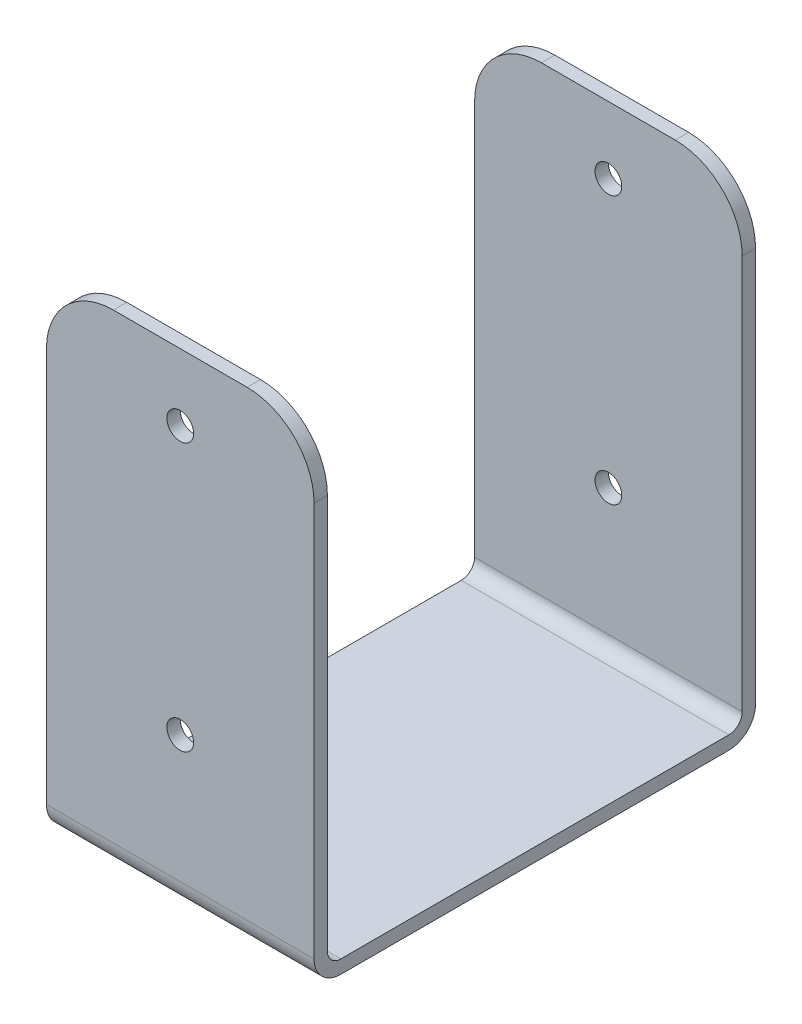
ISO-10303-21;
HEADER;
FILE_DESCRIPTION(('STEP AP214'),'2;1');
FILE_NAME('part.step','',(''),(''),'','','');
FILE_SCHEMA(('AUTOMOTIVE_DESIGN { 1 0 10303 214 1 1 1 1 }'));
ENDSEC;
DATA;
#1=APPLICATION_CONTEXT('core data for automotive mechanical design processes');
#2=APPLICATION_PROTOCOL_DEFINITION('international standard','automotive_design',2000,#1);
#3=PRODUCT_CONTEXT('',#1,'mechanical');
#4=PRODUCT('Part','Part','',(#3));
#5=PRODUCT_RELATED_PRODUCT_CATEGORY('part','',(#4));
#6=PRODUCT_DEFINITION_FORMATION('','',#4);
#7=PRODUCT_DEFINITION_CONTEXT('part definition',#1,'design');
#8=PRODUCT_DEFINITION('design','',#6,#7);
#9=PRODUCT_DEFINITION_SHAPE('','',#8);
#10=(LENGTH_UNIT() NAMED_UNIT(*) SI_UNIT(.MILLI.,.METRE.));
#11=(NAMED_UNIT(*) PLANE_ANGLE_UNIT() SI_UNIT($,.RADIAN.));
#12=(NAMED_UNIT(*) SI_UNIT($,.STERADIAN.) SOLID_ANGLE_UNIT());
#13=UNCERTAINTY_MEASURE_WITH_UNIT(LENGTH_MEASURE(1.E-05),#10,'distance_accuracy_value','');
#14=(GEOMETRIC_REPRESENTATION_CONTEXT(3) GLOBAL_UNCERTAINTY_ASSIGNED_CONTEXT((#13)) GLOBAL_UNIT_ASSIGNED_CONTEXT((#10,
#11,#12)) REPRESENTATION_CONTEXT('',''));
#15=CARTESIAN_POINT('',(0.,0.,0.));
#16=DIRECTION('',(0.,0.,1.));
#17=DIRECTION('',(1.,0.,0.));
#18=AXIS2_PLACEMENT_3D('',#15,#16,#17);
#19=CARTESIAN_POINT('',(514.894917120642,23.3157017452683,-231.556360518351));
#20=DIRECTION('',(-1.,0.,0.));
#21=DIRECTION('',(0.,0.,1.));
#22=AXIS2_PLACEMENT_3D('',#19,#20,#21);
#23=CYLINDRICAL_SURFACE('',#22,1.);
#24=CARTESIAN_POINT('',(514.894917120642,23.3157017452683,-231.556360518351));
#25=DIRECTION('',(-1.,0.,0.));
#26=DIRECTION('',(0.,0.,1.));
#27=AXIS2_PLACEMENT_3D('',#24,#25,#26);
#28=CIRCLE('',#27,1.);
#29=CARTESIAN_POINT('',(514.894917120642,22.3157017452683,-231.556360518351));
#30=VERTEX_POINT('',#29);
#31=CARTESIAN_POINT('',(514.894917120642,23.3157017452683,-230.556360518351));
#32=VERTEX_POINT('',#31);
#33=EDGE_CURVE('E134',#30,#32,#28,.T.);
#34=ORIENTED_EDGE('',*,*,#33,.F.);
#35=DIRECTION('',(1.,0.,0.));
#36=VECTOR('',#35,1.);
#37=CARTESIAN_POINT('',(514.894917120642,22.3157017452683,-231.556360518351));
#38=LINE('',#37,#36);
#39=CARTESIAN_POINT('',(494.894917120642,22.3157017452683,-231.556360518351));
#40=VERTEX_POINT('',#39);
#41=EDGE_CURVE('E136',#40,#30,#38,.T.);
#42=ORIENTED_EDGE('',*,*,#41,.F.);
#43=CARTESIAN_POINT('',(494.894917120642,23.3157017452683,-231.556360518351));
#44=DIRECTION('',(-1.,0.,0.));
#45=DIRECTION('',(0.,0.,1.));
#46=AXIS2_PLACEMENT_3D('',#43,#44,#45);
#47=CIRCLE('',#46,1.);
#48=CARTESIAN_POINT('',(494.894917120642,23.3157017452683,-230.556360518351));
#49=VERTEX_POINT('',#48);
#50=EDGE_CURVE('E20',#49,#40,#47,.F.);
#51=ORIENTED_EDGE('',*,*,#50,.F.);
#52=DIRECTION('',(-1.,0.,0.));
#53=VECTOR('',#52,1.);
#54=CARTESIAN_POINT('',(514.894917120642,23.3157017452683,-230.556360518351));
#55=LINE('',#54,#53);
#56=EDGE_CURVE('E209',#32,#49,#55,.T.);
#57=ORIENTED_EDGE('',*,*,#56,.F.);
#58=EDGE_LOOP('',(#34,#42,#51,#57));
#59=FACE_BOUND('',#58,.T.);
#60=ADVANCED_FACE('F17',(#59),#23,.F.);
#61=CARTESIAN_POINT('',(514.894917120642,23.3157017452683,-260.556360518351));
#62=DIRECTION('',(-1.,0.,0.));
#63=DIRECTION('',(0.,0.,1.));
#64=AXIS2_PLACEMENT_3D('',#61,#62,#63);
#65=CYLINDRICAL_SURFACE('',#64,1.);
#66=CARTESIAN_POINT('',(514.894917120642,23.3157017452683,-260.556360518351));
#67=DIRECTION('',(-1.,0.,0.));
#68=DIRECTION('',(0.,0.,1.));
#69=AXIS2_PLACEMENT_3D('',#66,#67,#68);
#70=CIRCLE('',#69,1.);
#71=CARTESIAN_POINT('',(514.894917120642,23.3157017452683,-261.556360518351));
#72=VERTEX_POINT('',#71);
#73=CARTESIAN_POINT('',(514.894917120642,22.3157017452683,-260.556360518351));
#74=VERTEX_POINT('',#73);
#75=EDGE_CURVE('E220',#72,#74,#70,.T.);
#76=ORIENTED_EDGE('',*,*,#75,.F.);
#77=DIRECTION('',(1.,0.,0.));
#78=VECTOR('',#77,1.);
#79=CARTESIAN_POINT('',(514.894917120642,23.3157017452683,-261.556360518351));
#80=LINE('',#79,#78);
#81=CARTESIAN_POINT('',(494.894917120642,23.3157017452683,-261.556360518351));
#82=VERTEX_POINT('',#81);
#83=EDGE_CURVE('E204',#82,#72,#80,.T.);
#84=ORIENTED_EDGE('',*,*,#83,.F.);
#85=CARTESIAN_POINT('',(494.894917120642,23.3157017452683,-260.556360518351));
#86=DIRECTION('',(-1.,0.,0.));
#87=DIRECTION('',(0.,0.,1.));
#88=AXIS2_PLACEMENT_3D('',#85,#86,#87);
#89=CIRCLE('',#88,1.);
#90=CARTESIAN_POINT('',(494.894917120642,22.3157017452683,-260.556360518351));
#91=VERTEX_POINT('',#90);
#92=EDGE_CURVE('E267',#91,#82,#89,.F.);
#93=ORIENTED_EDGE('',*,*,#92,.F.);
#94=DIRECTION('',(1.,0.,0.));
#95=VECTOR('',#94,1.);
#96=CARTESIAN_POINT('',(514.894917120642,22.3157017452683,-260.556360518351));
#97=LINE('',#96,#95);
#98=EDGE_CURVE('E141',#74,#91,#97,.F.);
#99=ORIENTED_EDGE('',*,*,#98,.F.);
#100=EDGE_LOOP('',(#76,#84,#93,#99));
#101=FACE_BOUND('',#100,.T.);
#102=ADVANCED_FACE('F329',(#101),#65,.F.);
#103=CARTESIAN_POINT('',(504.894917120642,52.8157017452683,-226.256336518351));
#104=DIRECTION('',(0.,0.,-1.));
#105=DIRECTION('',(-1.,0.,0.));
#106=AXIS2_PLACEMENT_3D('',#103,#104,#105);
#107=CYLINDRICAL_SURFACE('',#106,1.);
#108=CARTESIAN_POINT('',(504.894917120642,52.8157017452683,-262.556360518351));
#109=DIRECTION('',(0.,0.,-1.));
#110=DIRECTION('',(-1.,0.,0.));
#111=AXIS2_PLACEMENT_3D('',#108,#109,#110);
#112=CIRCLE('',#111,1.);
#113=CARTESIAN_POINT('',(503.894917120642,52.8157017452683,-262.556360518351));
#114=VERTEX_POINT('',#113);
#115=EDGE_CURVE('E206',#114,#114,#112,.F.);
#116=ORIENTED_EDGE('',*,*,#115,.F.);
#117=EDGE_LOOP('',(#116));
#118=FACE_BOUND('',#117,.T.);
#119=CARTESIAN_POINT('',(504.894917120642,52.8157017452683,-261.556360518351));
#120=DIRECTION('',(0.,0.,-1.));
#121=DIRECTION('',(-1.,0.,0.));
#122=AXIS2_PLACEMENT_3D('',#119,#120,#121);
#123=CIRCLE('',#122,1.);
#124=CARTESIAN_POINT('',(503.894917120642,52.8157017452683,-261.556360518351));
#125=VERTEX_POINT('',#124);
#126=EDGE_CURVE('E261',#125,#125,#123,.T.);
#127=ORIENTED_EDGE('',*,*,#126,.F.);
#128=EDGE_LOOP('',(#127));
#129=FACE_BOUND('',#128,.T.);
#130=ADVANCED_FACE('F331',(#118,#129),#107,.F.);
#131=CARTESIAN_POINT('',(504.894917120642,32.8157017452683,-226.256336518351));
#132=DIRECTION('',(0.,0.,-1.));
#133=DIRECTION('',(-1.,0.,0.));
#134=AXIS2_PLACEMENT_3D('',#131,#132,#133);
#135=CYLINDRICAL_SURFACE('',#134,1.);
#136=CARTESIAN_POINT('',(504.894917120642,32.8157017452683,-262.556360518351));
#137=DIRECTION('',(0.,0.,-1.));
#138=DIRECTION('',(-1.,0.,0.));
#139=AXIS2_PLACEMENT_3D('',#136,#137,#138);
#140=CIRCLE('',#139,1.);
#141=CARTESIAN_POINT('',(503.894917120642,32.8157017452683,-262.556360518351));
#142=VERTEX_POINT('',#141);
#143=EDGE_CURVE('E252',#142,#142,#140,.F.);
#144=ORIENTED_EDGE('',*,*,#143,.F.);
#145=EDGE_LOOP('',(#144));
#146=FACE_BOUND('',#145,.T.);
#147=CARTESIAN_POINT('',(504.894917120642,32.8157017452683,-261.556360518351));
#148=DIRECTION('',(0.,0.,-1.));
#149=DIRECTION('',(-1.,0.,0.));
#150=AXIS2_PLACEMENT_3D('',#147,#148,#149);
#151=CIRCLE('',#150,1.);
#152=CARTESIAN_POINT('',(503.894917120642,32.8157017452683,-261.556360518351));
#153=VERTEX_POINT('',#152);
#154=EDGE_CURVE('E140',#153,#153,#151,.T.);
#155=ORIENTED_EDGE('',*,*,#154,.F.);
#156=EDGE_LOOP('',(#155));
#157=FACE_BOUND('',#156,.T.);
#158=ADVANCED_FACE('F337',(#146,#157),#135,.F.);
#159=CARTESIAN_POINT('',(499.894917120642,52.8157017452683,-269.960616829488));
#160=DIRECTION('',(0.,0.,-1.));
#161=DIRECTION('',(-1.,0.,0.));
#162=AXIS2_PLACEMENT_3D('',#159,#160,#161);
#163=CYLINDRICAL_SURFACE('',#162,5.);
#164=DIRECTION('',(0.,0.,1.));
#165=VECTOR('',#164,1.);
#166=CARTESIAN_POINT('',(499.894917120642,57.8157017452683,-262.556360518351));
#167=LINE('',#166,#165);
#168=CARTESIAN_POINT('',(499.894917120642,57.8157017452683,-262.556360518351));
#169=VERTEX_POINT('',#168);
#170=CARTESIAN_POINT('',(499.894917120642,57.8157017452683,-261.556360518351));
#171=VERTEX_POINT('',#170);
#172=EDGE_CURVE('E215',#169,#171,#167,.T.);
#173=ORIENTED_EDGE('',*,*,#172,.F.);
#174=CARTESIAN_POINT('',(499.894917120642,52.8157017452683,-262.556360518351));
#175=DIRECTION('',(0.,0.,-1.));
#176=DIRECTION('',(-1.,0.,0.));
#177=AXIS2_PLACEMENT_3D('',#174,#175,#176);
#178=CIRCLE('',#177,5.);
#179=CARTESIAN_POINT('',(494.894917120642,52.8157017452683,-262.556360518351));
#180=VERTEX_POINT('',#179);
#181=EDGE_CURVE('E198',#180,#169,#178,.T.);
#182=ORIENTED_EDGE('',*,*,#181,.F.);
#183=DIRECTION('',(0.,0.,-1.));
#184=VECTOR('',#183,1.);
#185=CARTESIAN_POINT('',(494.894917120642,52.8157017452683,-269.960616829488));
#186=LINE('',#185,#184);
#187=CARTESIAN_POINT('',(494.894917120642,52.8157017452683,-261.556360518351));
#188=VERTEX_POINT('',#187);
#189=EDGE_CURVE('E218',#180,#188,#186,.F.);
#190=ORIENTED_EDGE('',*,*,#189,.T.);
#191=CARTESIAN_POINT('',(499.894917120642,52.8157017452683,-261.556360518351));
#192=DIRECTION('',(0.,0.,-1.));
#193=DIRECTION('',(-1.,0.,0.));
#194=AXIS2_PLACEMENT_3D('',#191,#192,#193);
#195=CIRCLE('',#194,5.);
#196=EDGE_CURVE('E202',#171,#188,#195,.F.);
#197=ORIENTED_EDGE('',*,*,#196,.F.);
#198=EDGE_LOOP('',(#173,#182,#190,#197));
#199=FACE_BOUND('',#198,.T.);
#200=ADVANCED_FACE('F382',(#199),#163,.T.);
#201=CARTESIAN_POINT('',(514.894917120642,57.8157017452683,-262.556360518351));
#202=DIRECTION('',(0.,1.,0.));
#203=DIRECTION('',(0.,0.,1.));
#204=AXIS2_PLACEMENT_3D('',#201,#202,#203);
#205=PLANE('',#204);
#206=ORIENTED_EDGE('',*,*,#172,.T.);
#207=DIRECTION('',(1.,0.,0.));
#208=VECTOR('',#207,1.);
#209=CARTESIAN_POINT('',(514.894917120642,57.8157017452683,-261.556360518351));
#210=LINE('',#209,#208);
#211=CARTESIAN_POINT('',(509.894917120642,57.8157017452683,-261.556360518351));
#212=VERTEX_POINT('',#211);
#213=EDGE_CURVE('E199',#212,#171,#210,.F.);
#214=ORIENTED_EDGE('',*,*,#213,.F.);
#215=DIRECTION('',(0.,0.,-1.));
#216=VECTOR('',#215,1.);
#217=CARTESIAN_POINT('',(509.894917120642,57.8157017452683,-269.960616829488));
#218=LINE('',#217,#216);
#219=CARTESIAN_POINT('',(509.894917120642,57.8157017452683,-262.556360518351));
#220=VERTEX_POINT('',#219);
#221=EDGE_CURVE('E211',#220,#212,#218,.F.);
#222=ORIENTED_EDGE('',*,*,#221,.F.);
#223=DIRECTION('',(-1.,0.,0.));
#224=VECTOR('',#223,1.);
#225=CARTESIAN_POINT('',(514.894917120642,57.8157017452683,-262.556360518351));
#226=LINE('',#225,#224);
#227=EDGE_CURVE('E195',#169,#220,#226,.F.);
#228=ORIENTED_EDGE('',*,*,#227,.F.);
#229=EDGE_LOOP('',(#206,#214,#222,#228));
#230=FACE_BOUND('',#229,.T.);
#231=ADVANCED_FACE('F379',(#230),#205,.T.);
#232=CARTESIAN_POINT('',(509.894917120642,52.8157017452683,-269.960616829488));
#233=DIRECTION('',(0.,0.,-1.));
#234=DIRECTION('',(-1.,0.,0.));
#235=AXIS2_PLACEMENT_3D('',#232,#233,#234);
#236=CYLINDRICAL_SURFACE('',#235,5.);
#237=ORIENTED_EDGE('',*,*,#221,.T.);
#238=CARTESIAN_POINT('',(509.894917120642,52.8157017452683,-261.556360518351));
#239=DIRECTION('',(0.,0.,-1.));
#240=DIRECTION('',(-1.,0.,0.));
#241=AXIS2_PLACEMENT_3D('',#238,#239,#240);
#242=CIRCLE('',#241,5.);
#243=CARTESIAN_POINT('',(514.894917120642,52.8157017452683,-261.556360518351));
#244=VERTEX_POINT('',#243);
#245=EDGE_CURVE('E203',#244,#212,#242,.F.);
#246=ORIENTED_EDGE('',*,*,#245,.F.);
#247=DIRECTION('',(0.,0.,-1.));
#248=VECTOR('',#247,1.);
#249=CARTESIAN_POINT('',(514.894917120642,52.8157017452683,-269.960616829488));
#250=LINE('',#249,#248);
#251=CARTESIAN_POINT('',(514.894917120642,52.8157017452683,-262.556360518351));
#252=VERTEX_POINT('',#251);
#253=EDGE_CURVE('E213',#244,#252,#250,.T.);
#254=ORIENTED_EDGE('',*,*,#253,.T.);
#255=CARTESIAN_POINT('',(509.894917120642,52.8157017452683,-262.556360518351));
#256=DIRECTION('',(0.,0.,-1.));
#257=DIRECTION('',(-1.,0.,0.));
#258=AXIS2_PLACEMENT_3D('',#255,#256,#257);
#259=CIRCLE('',#258,5.);
#260=EDGE_CURVE('E194',#220,#252,#259,.T.);
#261=ORIENTED_EDGE('',*,*,#260,.F.);
#262=EDGE_LOOP('',(#237,#246,#254,#261));
#263=FACE_BOUND('',#262,.T.);
#264=ADVANCED_FACE('F321',(#263),#236,.T.);
#265=CARTESIAN_POINT('',(514.894917120642,22.3157017452683,-230.556360518351));
#266=DIRECTION('',(0.,0.,-1.));
#267=DIRECTION('',(-1.,0.,0.));
#268=AXIS2_PLACEMENT_3D('',#265,#266,#267);
#269=PLANE('',#268);
#270=CARTESIAN_POINT('',(509.894917120642,52.8157017452683,-230.556360518351));
#271=DIRECTION('',(0.,0.,-1.));
#272=DIRECTION('',(-1.,0.,0.));
#273=AXIS2_PLACEMENT_3D('',#270,#271,#272);
#274=CIRCLE('',#273,5.);
#275=CARTESIAN_POINT('',(514.894917120642,52.8157017452683,-230.556360518351));
#276=VERTEX_POINT('',#275);
#277=CARTESIAN_POINT('',(509.894917120642,57.8157017452683,-230.556360518351));
#278=VERTEX_POINT('',#277);
#279=EDGE_CURVE('E164',#276,#278,#274,.F.);
#280=ORIENTED_EDGE('',*,*,#279,.F.);
#281=DIRECTION('',(0.,1.,0.));
#282=VECTOR('',#281,1.);
#283=CARTESIAN_POINT('',(514.894917120642,69.9291697379944,-230.556360518351));
#284=LINE('',#283,#282);
#285=EDGE_CURVE('E178',#276,#32,#284,.F.);
#286=ORIENTED_EDGE('',*,*,#285,.T.);
#287=ORIENTED_EDGE('',*,*,#56,.T.);
#288=DIRECTION('',(0.,1.,0.));
#289=VECTOR('',#288,1.);
#290=CARTESIAN_POINT('',(494.894917120642,69.9291697379944,-230.556360518351));
#291=LINE('',#290,#289);
#292=CARTESIAN_POINT('',(494.894917120642,52.8157017452683,-230.556360518351));
#293=VERTEX_POINT('',#292);
#294=EDGE_CURVE('E133',#293,#49,#291,.F.);
#295=ORIENTED_EDGE('',*,*,#294,.F.);
#296=CARTESIAN_POINT('',(499.894917120642,52.8157017452683,-230.556360518351));
#297=DIRECTION('',(0.,0.,-1.));
#298=DIRECTION('',(-1.,0.,0.));
#299=AXIS2_PLACEMENT_3D('',#296,#297,#298);
#300=CIRCLE('',#299,5.);
#301=CARTESIAN_POINT('',(499.894917120642,57.8157017452683,-230.556360518351));
#302=VERTEX_POINT('',#301);
#303=EDGE_CURVE('E155',#302,#293,#300,.F.);
#304=ORIENTED_EDGE('',*,*,#303,.F.);
#305=DIRECTION('',(1.,0.,0.));
#306=VECTOR('',#305,1.);
#307=CARTESIAN_POINT('',(514.894917120642,57.8157017452683,-230.556360518351));
#308=LINE('',#307,#306);
#309=EDGE_CURVE('E160',#278,#302,#308,.F.);
#310=ORIENTED_EDGE('',*,*,#309,.F.);
#311=EDGE_LOOP('',(#280,#286,#287,#295,#304,#310));
#312=FACE_BOUND('',#311,.T.);
#313=CARTESIAN_POINT('',(504.894917120642,52.8157017452683,-230.556360518351));
#314=DIRECTION('',(0.,0.,-1.));
#315=DIRECTION('',(-1.,0.,0.));
#316=AXIS2_PLACEMENT_3D('',#313,#314,#315);
#317=CIRCLE('',#316,1.);
#318=CARTESIAN_POINT('',(503.894917120642,52.8157017452683,-230.556360518351));
#319=VERTEX_POINT('',#318);
#320=EDGE_CURVE('E190',#319,#319,#317,.F.);
#321=ORIENTED_EDGE('',*,*,#320,.T.);
#322=EDGE_LOOP('',(#321));
#323=FACE_BOUND('',#322,.T.);
#324=CARTESIAN_POINT('',(504.894917120642,32.8157017452683,-230.556360518351));
#325=DIRECTION('',(0.,0.,-1.));
#326=DIRECTION('',(-1.,0.,0.));
#327=AXIS2_PLACEMENT_3D('',#324,#325,#326);
#328=CIRCLE('',#327,1.);
#329=CARTESIAN_POINT('',(503.894917120642,32.8157017452683,-230.556360518351));
#330=VERTEX_POINT('',#329);
#331=EDGE_CURVE('E181',#330,#330,#328,.F.);
#332=ORIENTED_EDGE('',*,*,#331,.T.);
#333=EDGE_LOOP('',(#332));
#334=FACE_BOUND('',#333,.T.);
#335=ADVANCED_FACE('F273',(#312,#323,#334),#269,.T.);
#336=CARTESIAN_POINT('',(514.894917120642,22.3157017452683,-261.556360518351));
#337=DIRECTION('',(0.,1.,0.));
#338=DIRECTION('',(0.,0.,1.));
#339=AXIS2_PLACEMENT_3D('',#336,#337,#338);
#340=PLANE('',#339);
#341=ORIENTED_EDGE('',*,*,#41,.T.);
#342=DIRECTION('',(0.,0.,1.));
#343=VECTOR('',#342,1.);
#344=CARTESIAN_POINT('',(514.894917120642,22.3157017452683,-269.960616829488));
#345=LINE('',#344,#343);
#346=EDGE_CURVE('E176',#30,#74,#345,.F.);
#347=ORIENTED_EDGE('',*,*,#346,.T.);
#348=ORIENTED_EDGE('',*,*,#98,.T.);
#349=DIRECTION('',(0.,0.,1.));
#350=VECTOR('',#349,1.);
#351=CARTESIAN_POINT('',(494.894917120642,22.3157017452683,-269.960616829488));
#352=LINE('',#351,#350);
#353=EDGE_CURVE('E130',#40,#91,#352,.F.);
#354=ORIENTED_EDGE('',*,*,#353,.F.);
#355=EDGE_LOOP('',(#341,#347,#348,#354));
#356=FACE_BOUND('',#355,.T.);
#357=ADVANCED_FACE('F144',(#356),#340,.T.);
#358=CARTESIAN_POINT('',(514.894917120642,52.8157017452683,-261.556360518351));
#359=DIRECTION('',(0.,0.,1.));
#360=DIRECTION('',(1.,0.,0.));
#361=AXIS2_PLACEMENT_3D('',#358,#359,#360);
#362=PLANE('',#361);
#363=DIRECTION('',(0.,1.,0.));
#364=VECTOR('',#363,1.);
#365=CARTESIAN_POINT('',(494.894917120642,69.9291697379944,-261.556360518351));
#366=LINE('',#365,#364);
#367=EDGE_CURVE('E146',#82,#188,#366,.T.);
#368=ORIENTED_EDGE('',*,*,#367,.F.);
#369=ORIENTED_EDGE('',*,*,#83,.T.);
#370=DIRECTION('',(0.,1.,0.));
#371=VECTOR('',#370,1.);
#372=CARTESIAN_POINT('',(514.894917120642,69.9291697379944,-261.556360518351));
#373=LINE('',#372,#371);
#374=EDGE_CURVE('E173',#72,#244,#373,.T.);
#375=ORIENTED_EDGE('',*,*,#374,.T.);
#376=ORIENTED_EDGE('',*,*,#245,.T.);
#377=ORIENTED_EDGE('',*,*,#213,.T.);
#378=ORIENTED_EDGE('',*,*,#196,.T.);
#379=EDGE_LOOP('',(#368,#369,#375,#376,#377,#378));
#380=FACE_BOUND('',#379,.T.);
#381=ORIENTED_EDGE('',*,*,#126,.T.);
#382=EDGE_LOOP('',(#381));
#383=FACE_BOUND('',#382,.T.);
#384=ORIENTED_EDGE('',*,*,#154,.T.);
#385=EDGE_LOOP('',(#384));
#386=FACE_BOUND('',#385,.T.);
#387=ADVANCED_FACE('F325',(#380,#383,#386),#362,.T.);
#388=CARTESIAN_POINT('',(514.894917120642,21.3157017452683,-262.556360518351));
#389=DIRECTION('',(0.,0.,-1.));
#390=DIRECTION('',(-1.,0.,0.));
#391=AXIS2_PLACEMENT_3D('',#388,#389,#390);
#392=PLANE('',#391);
#393=ORIENTED_EDGE('',*,*,#260,.T.);
#394=DIRECTION('',(0.,1.,0.));
#395=VECTOR('',#394,1.);
#396=CARTESIAN_POINT('',(514.894917120642,69.9291697379944,-262.556360518351));
#397=LINE('',#396,#395);
#398=CARTESIAN_POINT('',(514.894917120642,23.3157017452683,-262.556360518351));
#399=VERTEX_POINT('',#398);
#400=EDGE_CURVE('E171',#252,#399,#397,.F.);
#401=ORIENTED_EDGE('',*,*,#400,.T.);
#402=DIRECTION('',(-1.,0.,0.));
#403=VECTOR('',#402,1.);
#404=CARTESIAN_POINT('',(514.894917120642,23.3157017452683,-262.556360518351));
#405=LINE('',#404,#403);
#406=CARTESIAN_POINT('',(494.894917120642,23.3157017452683,-262.556360518351));
#407=VERTEX_POINT('',#406);
#408=EDGE_CURVE('E191',#407,#399,#405,.F.);
#409=ORIENTED_EDGE('',*,*,#408,.F.);
#410=DIRECTION('',(0.,1.,0.));
#411=VECTOR('',#410,1.);
#412=CARTESIAN_POINT('',(494.894917120642,69.9291697379944,-262.556360518351));
#413=LINE('',#412,#411);
#414=EDGE_CURVE('E149',#180,#407,#413,.F.);
#415=ORIENTED_EDGE('',*,*,#414,.F.);
#416=ORIENTED_EDGE('',*,*,#181,.T.);
#417=ORIENTED_EDGE('',*,*,#227,.T.);
#418=EDGE_LOOP('',(#393,#401,#409,#415,#416,#417));
#419=FACE_BOUND('',#418,.T.);
#420=ORIENTED_EDGE('',*,*,#143,.T.);
#421=EDGE_LOOP('',(#420));
#422=FACE_BOUND('',#421,.T.);
#423=ORIENTED_EDGE('',*,*,#115,.T.);
#424=EDGE_LOOP('',(#423));
#425=FACE_BOUND('',#424,.T.);
#426=ADVANCED_FACE('F305',(#419,#422,#425),#392,.T.);
#427=CARTESIAN_POINT('',(514.894917120642,23.3157017452683,-260.556360518351));
#428=DIRECTION('',(-1.,0.,0.));
#429=DIRECTION('',(0.,0.,1.));
#430=AXIS2_PLACEMENT_3D('',#427,#428,#429);
#431=CYLINDRICAL_SURFACE('',#430,2.);
#432=DIRECTION('',(1.,0.,0.));
#433=VECTOR('',#432,1.);
#434=CARTESIAN_POINT('',(514.894917120642,21.3157017452683,-260.556360518351));
#435=LINE('',#434,#433);
#436=CARTESIAN_POINT('',(494.894917120642,21.3157017452683,-260.556360518351));
#437=VERTEX_POINT('',#436);
#438=CARTESIAN_POINT('',(514.894917120642,21.3157017452683,-260.556360518351));
#439=VERTEX_POINT('',#438);
#440=EDGE_CURVE('E187',#437,#439,#435,.T.);
#441=ORIENTED_EDGE('',*,*,#440,.F.);
#442=CARTESIAN_POINT('',(494.894917120642,23.3157017452683,-260.556360518351));
#443=DIRECTION('',(-1.,0.,0.));
#444=DIRECTION('',(0.,0.,1.));
#445=AXIS2_PLACEMENT_3D('',#442,#443,#444);
#446=CIRCLE('',#445,2.);
#447=EDGE_CURVE('E238',#407,#437,#446,.T.);
#448=ORIENTED_EDGE('',*,*,#447,.F.);
#449=ORIENTED_EDGE('',*,*,#408,.T.);
#450=CARTESIAN_POINT('',(514.894917120642,23.3157017452683,-260.556360518351));
#451=DIRECTION('',(-1.,0.,0.));
#452=DIRECTION('',(0.,0.,1.));
#453=AXIS2_PLACEMENT_3D('',#450,#451,#452);
#454=CIRCLE('',#453,2.);
#455=EDGE_CURVE('E170',#399,#439,#454,.T.);
#456=ORIENTED_EDGE('',*,*,#455,.T.);
#457=EDGE_LOOP('',(#441,#448,#449,#456));
#458=FACE_BOUND('',#457,.T.);
#459=ADVANCED_FACE('F310',(#458),#431,.T.);
#460=CARTESIAN_POINT('',(514.894917120642,21.3157017452683,-229.556360518351));
#461=DIRECTION('',(0.,-1.,0.));
#462=DIRECTION('',(0.,0.,-1.));
#463=AXIS2_PLACEMENT_3D('',#460,#461,#462);
#464=PLANE('',#463);
#465=ORIENTED_EDGE('',*,*,#440,.T.);
#466=DIRECTION('',(0.,0.,1.));
#467=VECTOR('',#466,1.);
#468=CARTESIAN_POINT('',(514.894917120642,21.3157017452683,-269.960616829488));
#469=LINE('',#468,#467);
#470=CARTESIAN_POINT('',(514.894917120642,21.3157017452683,-231.556360518351));
#471=VERTEX_POINT('',#470);
#472=EDGE_CURVE('E168',#439,#471,#469,.T.);
#473=ORIENTED_EDGE('',*,*,#472,.T.);
#474=DIRECTION('',(-1.,0.,0.));
#475=VECTOR('',#474,1.);
#476=CARTESIAN_POINT('',(514.894917120642,21.3157017452683,-231.556360518351));
#477=LINE('',#476,#475);
#478=CARTESIAN_POINT('',(494.894917120642,21.3157017452683,-231.556360518351));
#479=VERTEX_POINT('',#478);
#480=EDGE_CURVE('E182',#479,#471,#477,.F.);
#481=ORIENTED_EDGE('',*,*,#480,.F.);
#482=DIRECTION('',(0.,0.,1.));
#483=VECTOR('',#482,1.);
#484=CARTESIAN_POINT('',(494.894917120642,21.3157017452683,-269.960616829488));
#485=LINE('',#484,#483);
#486=EDGE_CURVE('E186',#437,#479,#485,.T.);
#487=ORIENTED_EDGE('',*,*,#486,.F.);
#488=EDGE_LOOP('',(#465,#473,#481,#487));
#489=FACE_BOUND('',#488,.T.);
#490=ADVANCED_FACE('F314',(#489),#464,.T.);
#491=CARTESIAN_POINT('',(504.894917120642,52.8157017452683,-226.256336518351));
#492=DIRECTION('',(0.,0.,-1.));
#493=DIRECTION('',(-1.,0.,0.));
#494=AXIS2_PLACEMENT_3D('',#491,#492,#493);
#495=CYLINDRICAL_SURFACE('',#494,1.);
#496=ORIENTED_EDGE('',*,*,#320,.F.);
#497=EDGE_LOOP('',(#496));
#498=FACE_BOUND('',#497,.T.);
#499=CARTESIAN_POINT('',(504.894917120642,52.8157017452683,-229.556360518351));
#500=DIRECTION('',(0.,0.,-1.));
#501=DIRECTION('',(-1.,0.,0.));
#502=AXIS2_PLACEMENT_3D('',#499,#500,#501);
#503=CIRCLE('',#502,1.);
#504=CARTESIAN_POINT('',(503.894917120642,52.8157017452683,-229.556360518351));
#505=VERTEX_POINT('',#504);
#506=EDGE_CURVE('E232',#505,#505,#503,.T.);
#507=ORIENTED_EDGE('',*,*,#506,.F.);
#508=EDGE_LOOP('',(#507));
#509=FACE_BOUND('',#508,.T.);
#510=ADVANCED_FACE('F360',(#498,#509),#495,.F.);
#511=CARTESIAN_POINT('',(504.894917120642,32.8157017452683,-226.256336518351));
#512=DIRECTION('',(0.,0.,-1.));
#513=DIRECTION('',(-1.,0.,0.));
#514=AXIS2_PLACEMENT_3D('',#511,#512,#513);
#515=CYLINDRICAL_SURFACE('',#514,1.);
#516=CARTESIAN_POINT('',(504.894917120642,32.8157017452683,-229.556360518351));
#517=DIRECTION('',(0.,0.,-1.));
#518=DIRECTION('',(-1.,0.,0.));
#519=AXIS2_PLACEMENT_3D('',#516,#517,#518);
#520=CIRCLE('',#519,1.);
#521=CARTESIAN_POINT('',(503.894917120642,32.8157017452683,-229.556360518351));
#522=VERTEX_POINT('',#521);
#523=EDGE_CURVE('E229',#522,#522,#520,.T.);
#524=ORIENTED_EDGE('',*,*,#523,.F.);
#525=EDGE_LOOP('',(#524));
#526=FACE_BOUND('',#525,.T.);
#527=ORIENTED_EDGE('',*,*,#331,.F.);
#528=EDGE_LOOP('',(#527));
#529=FACE_BOUND('',#528,.T.);
#530=ADVANCED_FACE('F357',(#526,#529),#515,.F.);
#531=CARTESIAN_POINT('',(514.894917120642,69.9291697379944,-269.960616829488));
#532=DIRECTION('',(-1.,0.,0.));
#533=DIRECTION('',(0.,0.,1.));
#534=AXIS2_PLACEMENT_3D('',#531,#532,#533);
#535=PLANE('',#534);
#536=DIRECTION('',(0.,1.,0.));
#537=VECTOR('',#536,1.);
#538=CARTESIAN_POINT('',(514.894917120642,52.8157017452683,-229.556360518351));
#539=LINE('',#538,#537);
#540=CARTESIAN_POINT('',(514.894917120642,23.3157017452683,-229.556360518351));
#541=VERTEX_POINT('',#540);
#542=CARTESIAN_POINT('',(514.894917120642,52.8157017452683,-229.556360518351));
#543=VERTEX_POINT('',#542);
#544=EDGE_CURVE('E228',#541,#543,#539,.T.);
#545=ORIENTED_EDGE('',*,*,#544,.F.);
#546=CARTESIAN_POINT('',(514.894917120642,23.3157017452683,-231.556360518351));
#547=DIRECTION('',(-1.,0.,0.));
#548=DIRECTION('',(0.,0.,1.));
#549=AXIS2_PLACEMENT_3D('',#546,#547,#548);
#550=CIRCLE('',#549,2.);
#551=EDGE_CURVE('E185',#471,#541,#550,.T.);
#552=ORIENTED_EDGE('',*,*,#551,.F.);
#553=ORIENTED_EDGE('',*,*,#472,.F.);
#554=ORIENTED_EDGE('',*,*,#455,.F.);
#555=ORIENTED_EDGE('',*,*,#400,.F.);
#556=ORIENTED_EDGE('',*,*,#253,.F.);
#557=ORIENTED_EDGE('',*,*,#374,.F.);
#558=ORIENTED_EDGE('',*,*,#75,.T.);
#559=ORIENTED_EDGE('',*,*,#346,.F.);
#560=ORIENTED_EDGE('',*,*,#33,.T.);
#561=ORIENTED_EDGE('',*,*,#285,.F.);
#562=DIRECTION('',(0.,0.,-1.));
#563=VECTOR('',#562,1.);
#564=CARTESIAN_POINT('',(514.894917120642,52.8157017452683,-269.960616829488));
#565=LINE('',#564,#563);
#566=EDGE_CURVE('E165',#543,#276,#565,.T.);
#567=ORIENTED_EDGE('',*,*,#566,.F.);
#568=EDGE_LOOP('',(#545,#552,#553,#554,#555,#556,#557,#558,#559,#560,#561,#567));
#569=FACE_BOUND('',#568,.T.);
#570=ADVANCED_FACE('F269',(#569),#535,.F.);
#571=CARTESIAN_POINT('',(509.894917120642,52.8157017452683,-269.960616829488));
#572=DIRECTION('',(0.,0.,-1.));
#573=DIRECTION('',(-1.,0.,0.));
#574=AXIS2_PLACEMENT_3D('',#571,#572,#573);
#575=CYLINDRICAL_SURFACE('',#574,5.);
#576=DIRECTION('',(0.,0.,1.));
#577=VECTOR('',#576,1.);
#578=CARTESIAN_POINT('',(509.894917120642,57.8157017452683,-230.556360518351));
#579=LINE('',#578,#577);
#580=CARTESIAN_POINT('',(509.894917120642,57.8157017452683,-229.556360518351));
#581=VERTEX_POINT('',#580);
#582=EDGE_CURVE('E161',#581,#278,#579,.F.);
#583=ORIENTED_EDGE('',*,*,#582,.F.);
#584=CARTESIAN_POINT('',(509.894917120642,52.8157017452683,-229.556360518351));
#585=DIRECTION('',(0.,0.,-1.));
#586=DIRECTION('',(-1.,0.,0.));
#587=AXIS2_PLACEMENT_3D('',#584,#585,#586);
#588=CIRCLE('',#587,5.);
#589=EDGE_CURVE('E225',#543,#581,#588,.F.);
#590=ORIENTED_EDGE('',*,*,#589,.F.);
#591=ORIENTED_EDGE('',*,*,#566,.T.);
#592=ORIENTED_EDGE('',*,*,#279,.T.);
#593=EDGE_LOOP('',(#583,#590,#591,#592));
#594=FACE_BOUND('',#593,.T.);
#595=ADVANCED_FACE('F280',(#594),#575,.T.);
#596=CARTESIAN_POINT('',(514.894917120642,57.8157017452683,-230.556360518351));
#597=DIRECTION('',(0.,1.,0.));
#598=DIRECTION('',(0.,0.,1.));
#599=AXIS2_PLACEMENT_3D('',#596,#597,#598);
#600=PLANE('',#599);
#601=DIRECTION('',(0.,0.,-1.));
#602=VECTOR('',#601,1.);
#603=CARTESIAN_POINT('',(499.894917120642,57.8157017452683,-269.960616829488));
#604=LINE('',#603,#602);
#605=CARTESIAN_POINT('',(499.894917120642,57.8157017452683,-229.556360518351));
#606=VERTEX_POINT('',#605);
#607=EDGE_CURVE('E157',#606,#302,#604,.T.);
#608=ORIENTED_EDGE('',*,*,#607,.F.);
#609=DIRECTION('',(1.,0.,0.));
#610=VECTOR('',#609,1.);
#611=CARTESIAN_POINT('',(514.894917120642,57.8157017452683,-229.556360518351));
#612=LINE('',#611,#610);
#613=EDGE_CURVE('E224',#581,#606,#612,.F.);
#614=ORIENTED_EDGE('',*,*,#613,.F.);
#615=ORIENTED_EDGE('',*,*,#582,.T.);
#616=ORIENTED_EDGE('',*,*,#309,.T.);
#617=EDGE_LOOP('',(#608,#614,#615,#616));
#618=FACE_BOUND('',#617,.T.);
#619=ADVANCED_FACE('F288',(#618),#600,.T.);
#620=CARTESIAN_POINT('',(499.894917120642,52.8157017452683,-269.960616829488));
#621=DIRECTION('',(0.,0.,-1.));
#622=DIRECTION('',(-1.,0.,0.));
#623=AXIS2_PLACEMENT_3D('',#620,#621,#622);
#624=CYLINDRICAL_SURFACE('',#623,5.);
#625=ORIENTED_EDGE('',*,*,#607,.T.);
#626=ORIENTED_EDGE('',*,*,#303,.T.);
#627=DIRECTION('',(0.,0.,1.));
#628=VECTOR('',#627,1.);
#629=CARTESIAN_POINT('',(494.894917120642,52.8157017452683,-269.960616829488));
#630=LINE('',#629,#628);
#631=CARTESIAN_POINT('',(494.894917120642,52.8157017452683,-229.556360518351));
#632=VERTEX_POINT('',#631);
#633=EDGE_CURVE('E151',#632,#293,#630,.F.);
#634=ORIENTED_EDGE('',*,*,#633,.F.);
#635=CARTESIAN_POINT('',(499.894917120642,52.8157017452683,-229.556360518351));
#636=DIRECTION('',(0.,0.,-1.));
#637=DIRECTION('',(-1.,0.,0.));
#638=AXIS2_PLACEMENT_3D('',#635,#636,#637);
#639=CIRCLE('',#638,5.);
#640=EDGE_CURVE('E221',#606,#632,#639,.F.);
#641=ORIENTED_EDGE('',*,*,#640,.F.);
#642=EDGE_LOOP('',(#625,#626,#634,#641));
#643=FACE_BOUND('',#642,.T.);
#644=ADVANCED_FACE('F291',(#643),#624,.T.);
#645=CARTESIAN_POINT('',(494.894917120642,69.9291697379944,-269.960616829488));
#646=DIRECTION('',(-1.,0.,0.));
#647=DIRECTION('',(0.,0.,1.));
#648=AXIS2_PLACEMENT_3D('',#645,#646,#647);
#649=PLANE('',#648);
#650=CARTESIAN_POINT('',(494.894917120642,23.3157017452683,-231.556360518351));
#651=DIRECTION('',(-1.,0.,0.));
#652=DIRECTION('',(0.,0.,1.));
#653=AXIS2_PLACEMENT_3D('',#650,#651,#652);
#654=CIRCLE('',#653,2.);
#655=CARTESIAN_POINT('',(494.894917120642,23.3157017452683,-229.556360518351));
#656=VERTEX_POINT('',#655);
#657=EDGE_CURVE('E35',#656,#479,#654,.F.);
#658=ORIENTED_EDGE('',*,*,#657,.F.);
#659=DIRECTION('',(0.,1.,0.));
#660=VECTOR('',#659,1.);
#661=CARTESIAN_POINT('',(494.894917120642,52.8157017452683,-229.556360518351));
#662=LINE('',#661,#660);
#663=EDGE_CURVE('E26',#632,#656,#662,.F.);
#664=ORIENTED_EDGE('',*,*,#663,.F.);
#665=ORIENTED_EDGE('',*,*,#633,.T.);
#666=ORIENTED_EDGE('',*,*,#294,.T.);
#667=ORIENTED_EDGE('',*,*,#50,.T.);
#668=ORIENTED_EDGE('',*,*,#353,.T.);
#669=ORIENTED_EDGE('',*,*,#92,.T.);
#670=ORIENTED_EDGE('',*,*,#367,.T.);
#671=ORIENTED_EDGE('',*,*,#189,.F.);
#672=ORIENTED_EDGE('',*,*,#414,.T.);
#673=ORIENTED_EDGE('',*,*,#447,.T.);
#674=ORIENTED_EDGE('',*,*,#486,.T.);
#675=EDGE_LOOP('',(#658,#664,#665,#666,#667,#668,#669,#670,#671,#672,#673,#674));
#676=FACE_BOUND('',#675,.T.);
#677=ADVANCED_FACE('F128',(#676),#649,.T.);
#678=CARTESIAN_POINT('',(514.894917120642,23.3157017452683,-231.556360518351));
#679=DIRECTION('',(-1.,0.,0.));
#680=DIRECTION('',(0.,0.,1.));
#681=AXIS2_PLACEMENT_3D('',#678,#679,#680);
#682=CYLINDRICAL_SURFACE('',#681,2.);
#683=DIRECTION('',(1.,0.,0.));
#684=VECTOR('',#683,1.);
#685=CARTESIAN_POINT('',(514.894917120642,23.3157017452683,-229.556360518351));
#686=LINE('',#685,#684);
#687=EDGE_CURVE('E11',#656,#541,#686,.T.);
#688=ORIENTED_EDGE('',*,*,#687,.F.);
#689=ORIENTED_EDGE('',*,*,#657,.T.);
#690=ORIENTED_EDGE('',*,*,#480,.T.);
#691=ORIENTED_EDGE('',*,*,#551,.T.);
#692=EDGE_LOOP('',(#688,#689,#690,#691));
#693=FACE_BOUND('',#692,.T.);
#694=ADVANCED_FACE('F316',(#693),#682,.T.);
#695=CARTESIAN_POINT('',(514.894917120642,52.8157017452683,-229.556360518351));
#696=DIRECTION('',(0.,0.,1.));
#697=DIRECTION('',(1.,0.,0.));
#698=AXIS2_PLACEMENT_3D('',#695,#696,#697);
#699=PLANE('',#698);
#700=ORIENTED_EDGE('',*,*,#663,.T.);
#701=ORIENTED_EDGE('',*,*,#687,.T.);
#702=ORIENTED_EDGE('',*,*,#544,.T.);
#703=ORIENTED_EDGE('',*,*,#589,.T.);
#704=ORIENTED_EDGE('',*,*,#613,.T.);
#705=ORIENTED_EDGE('',*,*,#640,.T.);
#706=EDGE_LOOP('',(#700,#701,#702,#703,#704,#705));
#707=FACE_BOUND('',#706,.T.);
#708=ORIENTED_EDGE('',*,*,#523,.T.);
#709=EDGE_LOOP('',(#708));
#710=FACE_BOUND('',#709,.T.);
#711=ORIENTED_EDGE('',*,*,#506,.T.);
#712=EDGE_LOOP('',(#711));
#713=FACE_BOUND('',#712,.T.);
#714=ADVANCED_FACE('F294',(#707,#710,#713),#699,.T.);
#715=CLOSED_SHELL('',(#60,#102,#130,#158,#200,#231,#264,#335,#357,#387,#426,#459,#490,#510,#530,
#570,#595,#619,#644,#677,#694,#714));
#716=MANIFOLD_SOLID_BREP('B1',#715);
#717=ADVANCED_BREP_SHAPE_REPRESENTATION('',(#18,#716),#14);
#718=SHAPE_DEFINITION_REPRESENTATION(#9,#717);
ENDSEC;
END-ISO-10303-21;
